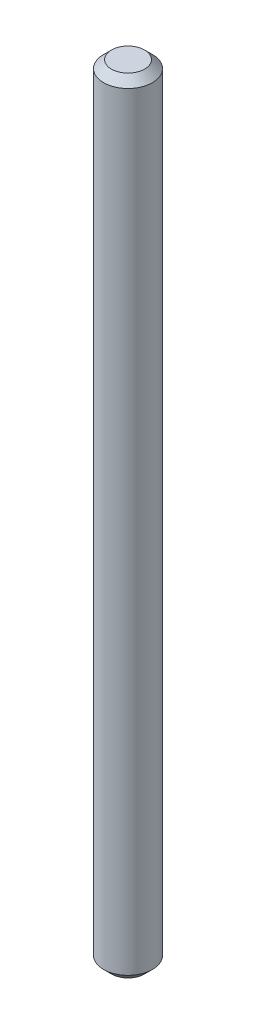
ISO-10303-21;
HEADER;
FILE_DESCRIPTION(('STEP AP214'),'2;1');
FILE_NAME('part.step','',(''),(''),'','','');
FILE_SCHEMA(('AUTOMOTIVE_DESIGN { 1 0 10303 214 1 1 1 1 }'));
ENDSEC;
DATA;
#1=APPLICATION_CONTEXT('core data for automotive mechanical design processes');
#2=APPLICATION_PROTOCOL_DEFINITION('international standard','automotive_design',2000,#1);
#3=PRODUCT_CONTEXT('',#1,'mechanical');
#4=PRODUCT('Part','Part','',(#3));
#5=PRODUCT_RELATED_PRODUCT_CATEGORY('part','',(#4));
#6=PRODUCT_DEFINITION_FORMATION('','',#4);
#7=PRODUCT_DEFINITION_CONTEXT('part definition',#1,'design');
#8=PRODUCT_DEFINITION('design','',#6,#7);
#9=PRODUCT_DEFINITION_SHAPE('','',#8);
#10=(LENGTH_UNIT() NAMED_UNIT(*) SI_UNIT(.MILLI.,.METRE.));
#11=(NAMED_UNIT(*) PLANE_ANGLE_UNIT() SI_UNIT($,.RADIAN.));
#12=(NAMED_UNIT(*) SI_UNIT($,.STERADIAN.) SOLID_ANGLE_UNIT());
#13=UNCERTAINTY_MEASURE_WITH_UNIT(LENGTH_MEASURE(1.E-05),#10,'distance_accuracy_value','');
#14=(GEOMETRIC_REPRESENTATION_CONTEXT(3) GLOBAL_UNCERTAINTY_ASSIGNED_CONTEXT((#13)) GLOBAL_UNIT_ASSIGNED_CONTEXT((#10,
#11,#12)) REPRESENTATION_CONTEXT('',''));
#15=CARTESIAN_POINT('',(0.,0.,0.));
#16=DIRECTION('',(0.,0.,1.));
#17=DIRECTION('',(1.,0.,0.));
#18=AXIS2_PLACEMENT_3D('',#15,#16,#17);
#19=CARTESIAN_POINT('',(0.,50.292,0.));
#20=DIRECTION('',(0.,-1.,0.));
#21=DIRECTION('',(0.,0.,-1.));
#22=AXIS2_PLACEMENT_3D('',#19,#20,#21);
#23=CONICAL_SURFACE('',#22,1.58369000000001,0.78539816339745);
#24=CARTESIAN_POINT('',(0.,50.8,0.));
#25=DIRECTION('',(0.,-1.,0.));
#26=DIRECTION('',(0.,0.,-1.));
#27=AXIS2_PLACEMENT_3D('',#24,#25,#26);
#28=CIRCLE('',#27,1.07569000000002);
#29=CARTESIAN_POINT('',(0.,50.8,-1.07569000000002));
#30=VERTEX_POINT('',#29);
#31=EDGE_CURVE('E53',#30,#30,#28,.T.);
#32=ORIENTED_EDGE('',*,*,#31,.T.);
#33=EDGE_LOOP('',(#32));
#34=FACE_BOUND('',#33,.T.);
#35=CARTESIAN_POINT('',(0.,50.292,0.));
#36=DIRECTION('',(0.,-1.,0.));
#37=DIRECTION('',(0.,0.,-1.));
#38=AXIS2_PLACEMENT_3D('',#35,#36,#37);
#39=CIRCLE('',#38,1.58369000000001);
#40=CARTESIAN_POINT('',(0.,50.292,-1.58369000000001));
#41=VERTEX_POINT('',#40);
#42=EDGE_CURVE('E10',#41,#41,#39,.T.);
#43=ORIENTED_EDGE('',*,*,#42,.F.);
#44=EDGE_LOOP('',(#43));
#45=FACE_BOUND('',#44,.T.);
#46=ADVANCED_FACE('F39',(#34,#45),#23,.T.);
#47=CARTESIAN_POINT('',(0.,50.8,0.));
#48=DIRECTION('',(0.,-1.,0.));
#49=DIRECTION('',(0.,0.,-1.));
#50=AXIS2_PLACEMENT_3D('',#47,#48,#49);
#51=CYLINDRICAL_SURFACE('',#50,1.58369000000001);
#52=ORIENTED_EDGE('',*,*,#42,.T.);
#53=EDGE_LOOP('',(#52));
#54=FACE_BOUND('',#53,.T.);
#55=CARTESIAN_POINT('',(0.,0.508000000000008,0.));
#56=DIRECTION('',(0.,-1.,0.));
#57=DIRECTION('',(0.,0.,-1.));
#58=AXIS2_PLACEMENT_3D('',#55,#56,#57);
#59=CIRCLE('',#58,1.58369);
#60=CARTESIAN_POINT('',(0.,0.508000000000008,-1.58369));
#61=VERTEX_POINT('',#60);
#62=EDGE_CURVE('E45',#61,#61,#59,.T.);
#63=ORIENTED_EDGE('',*,*,#62,.F.);
#64=EDGE_LOOP('',(#63));
#65=FACE_BOUND('',#64,.T.);
#66=ADVANCED_FACE('F72',(#54,#65),#51,.T.);
#67=CARTESIAN_POINT('',(0.,0.,0.));
#68=DIRECTION('',(0.,1.,0.));
#69=DIRECTION('',(0.,0.,1.));
#70=AXIS2_PLACEMENT_3D('',#67,#68,#69);
#71=CONICAL_SURFACE('',#70,1.07568999999999,0.785398163397451);
#72=ORIENTED_EDGE('',*,*,#62,.T.);
#73=EDGE_LOOP('',(#72));
#74=FACE_BOUND('',#73,.T.);
#75=CARTESIAN_POINT('',(0.,0.,0.));
#76=DIRECTION('',(0.,-1.,0.));
#77=DIRECTION('',(0.,0.,-1.));
#78=AXIS2_PLACEMENT_3D('',#75,#76,#77);
#79=CIRCLE('',#78,1.07568999999999);
#80=CARTESIAN_POINT('',(0.,0.,-1.07568999999999));
#81=VERTEX_POINT('',#80);
#82=EDGE_CURVE('E49',#81,#81,#79,.T.);
#83=ORIENTED_EDGE('',*,*,#82,.F.);
#84=EDGE_LOOP('',(#83));
#85=FACE_BOUND('',#84,.T.);
#86=ADVANCED_FACE('F68',(#74,#85),#71,.T.);
#87=CARTESIAN_POINT('',(0.,0.,0.));
#88=DIRECTION('',(0.,-1.,0.));
#89=DIRECTION('',(0.,0.,-1.));
#90=AXIS2_PLACEMENT_3D('',#87,#88,#89);
#91=PLANE('',#90);
#92=ORIENTED_EDGE('',*,*,#82,.T.);
#93=EDGE_LOOP('',(#92));
#94=FACE_BOUND('',#93,.T.);
#95=ADVANCED_FACE('F63',(#94),#91,.T.);
#96=CARTESIAN_POINT('',(1.07569000000002,50.8,0.));
#97=DIRECTION('',(0.,1.,0.));
#98=DIRECTION('',(0.,0.,1.));
#99=AXIS2_PLACEMENT_3D('',#96,#97,#98);
#100=PLANE('',#99);
#101=ORIENTED_EDGE('',*,*,#31,.F.);
#102=EDGE_LOOP('',(#101));
#103=FACE_BOUND('',#102,.T.);
#104=ADVANCED_FACE('F61',(#103),#100,.T.);
#105=CLOSED_SHELL('',(#46,#66,#86,#95,#104));
#106=MANIFOLD_SOLID_BREP('B2',#105);
#107=ADVANCED_BREP_SHAPE_REPRESENTATION('',(#18,#106),#14);
#108=SHAPE_DEFINITION_REPRESENTATION(#9,#107);
ENDSEC;
END-ISO-10303-21;
